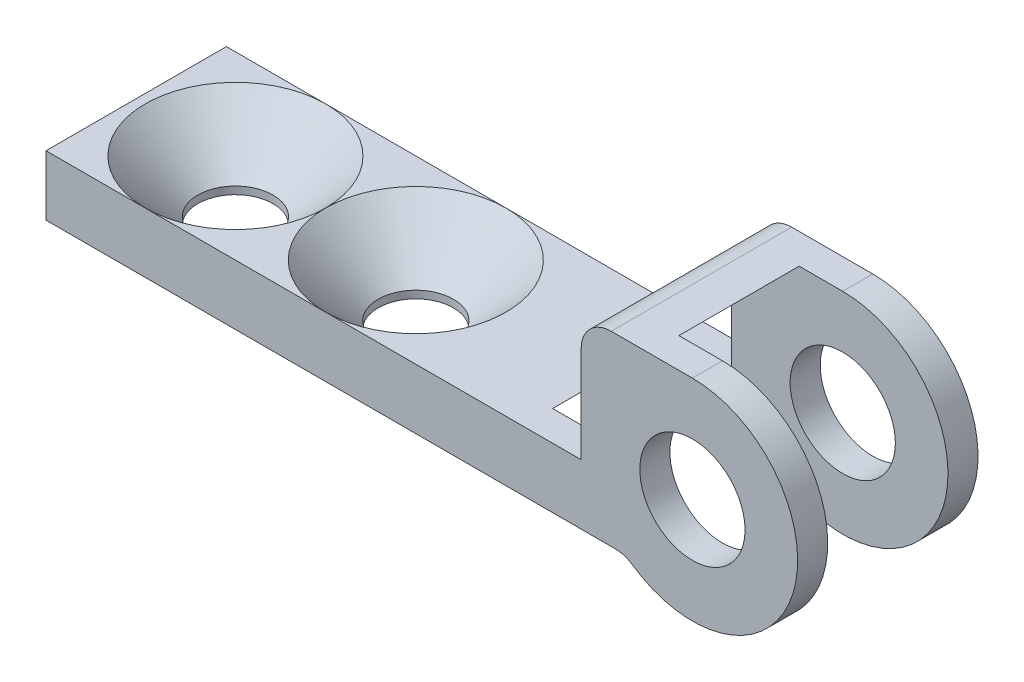
ISO-10303-21;
HEADER;
FILE_DESCRIPTION(('STEP AP214'),'2;1');
FILE_NAME('part.step','',(''),(''),'','','');
FILE_SCHEMA(('AUTOMOTIVE_DESIGN { 1 0 10303 214 1 1 1 1 }'));
ENDSEC;
DATA;
#1=APPLICATION_CONTEXT('core data for automotive mechanical design processes');
#2=APPLICATION_PROTOCOL_DEFINITION('international standard','automotive_design',2000,#1);
#3=PRODUCT_CONTEXT('',#1,'mechanical');
#4=PRODUCT('Part','Part','',(#3));
#5=PRODUCT_RELATED_PRODUCT_CATEGORY('part','',(#4));
#6=PRODUCT_DEFINITION_FORMATION('','',#4);
#7=PRODUCT_DEFINITION_CONTEXT('part definition',#1,'design');
#8=PRODUCT_DEFINITION('design','',#6,#7);
#9=PRODUCT_DEFINITION_SHAPE('','',#8);
#10=(LENGTH_UNIT() NAMED_UNIT(*) SI_UNIT(.MILLI.,.METRE.));
#11=(NAMED_UNIT(*) PLANE_ANGLE_UNIT() SI_UNIT($,.RADIAN.));
#12=(NAMED_UNIT(*) SI_UNIT($,.STERADIAN.) SOLID_ANGLE_UNIT());
#13=UNCERTAINTY_MEASURE_WITH_UNIT(LENGTH_MEASURE(1.E-05),#10,'distance_accuracy_value','');
#14=(GEOMETRIC_REPRESENTATION_CONTEXT(3) GLOBAL_UNCERTAINTY_ASSIGNED_CONTEXT((#13)) GLOBAL_UNIT_ASSIGNED_CONTEXT((#10,
#11,#12)) REPRESENTATION_CONTEXT('',''));
#15=CARTESIAN_POINT('',(0.,0.,0.));
#16=DIRECTION('',(0.,0.,1.));
#17=DIRECTION('',(1.,0.,0.));
#18=AXIS2_PLACEMENT_3D('',#15,#16,#17);
#19=CARTESIAN_POINT('',(0.86993036691125,6.15104880777221,1.5));
#20=DIRECTION('',(0.,0.,1.));
#21=DIRECTION('',(1.,0.,0.));
#22=AXIS2_PLACEMENT_3D('',#19,#20,#21);
#23=CYLINDRICAL_SURFACE('',#22,1.);
#24=CARTESIAN_POINT('',(0.86993036691125,6.15104880777221,-3.));
#25=DIRECTION('',(0.,0.,1.));
#26=DIRECTION('',(1.,0.,0.));
#27=AXIS2_PLACEMENT_3D('',#24,#25,#26);
#28=CIRCLE('',#27,1.);
#29=CARTESIAN_POINT('',(0.86993036691125,7.15104880777221,-3.));
#30=VERTEX_POINT('',#29);
#31=CARTESIAN_POINT('',(-0.13006963308875,6.15104880777221,-3.));
#32=VERTEX_POINT('',#31);
#33=EDGE_CURVE('E160',#30,#32,#28,.T.);
#34=ORIENTED_EDGE('',*,*,#33,.T.);
#35=DIRECTION('',(0.,0.,-1.));
#36=VECTOR('',#35,1.);
#37=CARTESIAN_POINT('',(-0.13006963308875,6.15104880777221,3.));
#38=LINE('',#37,#36);
#39=CARTESIAN_POINT('',(-0.13006963308875,6.15104880777221,3.));
#40=VERTEX_POINT('',#39);
#41=EDGE_CURVE('E158',#32,#40,#38,.F.);
#42=ORIENTED_EDGE('',*,*,#41,.T.);
#43=CARTESIAN_POINT('',(0.86993036691125,6.15104880777221,3.));
#44=DIRECTION('',(0.,0.,1.));
#45=DIRECTION('',(1.,0.,0.));
#46=AXIS2_PLACEMENT_3D('',#43,#44,#45);
#47=CIRCLE('',#46,1.);
#48=CARTESIAN_POINT('',(0.86993036691125,7.15104880777221,3.));
#49=VERTEX_POINT('',#48);
#50=EDGE_CURVE('E19',#40,#49,#47,.F.);
#51=ORIENTED_EDGE('',*,*,#50,.T.);
#52=DIRECTION('',(0.,0.,1.));
#53=VECTOR('',#52,1.);
#54=CARTESIAN_POINT('',(0.86993036691125,7.15104880777221,0.));
#55=LINE('',#54,#53);
#56=EDGE_CURVE('E155',#30,#49,#55,.T.);
#57=ORIENTED_EDGE('',*,*,#56,.F.);
#58=EDGE_LOOP('',(#34,#42,#51,#57));
#59=FACE_BOUND('',#58,.T.);
#60=ADVANCED_FACE('F16',(#59),#23,.T.);
#61=CARTESIAN_POINT('',(-4.49303683807458,1.55104880777221,-0.7));
#62=DIRECTION('',(0.,1.,0.));
#63=DIRECTION('',(-1.,0.,0.));
#64=AXIS2_PLACEMENT_3D('',#61,#62,#63);
#65=PLANE('',#64);
#66=DIRECTION('',(1.,0.,0.));
#67=VECTOR('',#66,1.);
#68=CARTESIAN_POINT('',(-2.525276673201,1.55104880777221,-0.4));
#69=LINE('',#68,#67);
#70=CARTESIAN_POINT('',(-3.47981710139458,1.55104880777221,-0.4));
#71=VERTEX_POINT('',#70);
#72=CARTESIAN_POINT('',(-6.27981710139458,1.55104880777221,-0.4));
#73=VERTEX_POINT('',#72);
#74=EDGE_CURVE('E217',#71,#73,#69,.F.);
#75=ORIENTED_EDGE('',*,*,#74,.T.);
#76=CARTESIAN_POINT('',(-6.27981710139458,1.55104880777221,-0.7));
#77=DIRECTION('',(0.,1.,0.));
#78=DIRECTION('',(0.,0.,1.));
#79=AXIS2_PLACEMENT_3D('',#76,#77,#78);
#80=CIRCLE('',#79,0.3);
#81=CARTESIAN_POINT('',(-6.27981710139458,1.55104880777221,-1.));
#82=VERTEX_POINT('',#81);
#83=EDGE_CURVE('E230',#73,#82,#80,.F.);
#84=ORIENTED_EDGE('',*,*,#83,.T.);
#85=DIRECTION('',(-1.,0.,0.));
#86=VECTOR('',#85,1.);
#87=CARTESIAN_POINT('',(-6.27981710139458,1.55104880777221,-1.));
#88=LINE('',#87,#86);
#89=CARTESIAN_POINT('',(-3.47981710139458,1.55104880777221,-1.));
#90=VERTEX_POINT('',#89);
#91=EDGE_CURVE('E231',#82,#90,#88,.F.);
#92=ORIENTED_EDGE('',*,*,#91,.T.);
#93=DIRECTION('',(0.,0.,1.));
#94=VECTOR('',#93,1.);
#95=CARTESIAN_POINT('',(-3.47981710139458,1.55104880777221,-0.7));
#96=LINE('',#95,#94);
#97=EDGE_CURVE('E309',#71,#90,#96,.F.);
#98=ORIENTED_EDGE('',*,*,#97,.F.);
#99=EDGE_LOOP('',(#75,#84,#92,#98));
#100=FACE_BOUND('',#99,.T.);
#101=ADVANCED_FACE('F657',(#100),#65,.F.);
#102=CARTESIAN_POINT('',(3.56993036691125,3.65104880777221,-1.));
#103=DIRECTION('',(0.,0.,1.));
#104=DIRECTION('',(1.,0.,0.));
#105=AXIS2_PLACEMENT_3D('',#102,#103,#104);
#106=CYLINDRICAL_SURFACE('',#105,1.75);
#107=CARTESIAN_POINT('',(3.56993036691125,3.65104880777221,3.));
#108=DIRECTION('',(0.,0.,1.));
#109=DIRECTION('',(1.,0.,0.));
#110=AXIS2_PLACEMENT_3D('',#107,#108,#109);
#111=CIRCLE('',#110,1.75);
#112=CARTESIAN_POINT('',(5.31993036691125,3.65104880777221,3.));
#113=VERTEX_POINT('',#112);
#114=EDGE_CURVE('E197',#113,#113,#111,.F.);
#115=ORIENTED_EDGE('',*,*,#114,.F.);
#116=EDGE_LOOP('',(#115));
#117=FACE_BOUND('',#116,.T.);
#118=CARTESIAN_POINT('',(3.56993036691125,3.65104880777221,2.));
#119=DIRECTION('',(0.,0.,1.));
#120=DIRECTION('',(1.,0.,0.));
#121=AXIS2_PLACEMENT_3D('',#118,#119,#120);
#122=CIRCLE('',#121,1.75);
#123=CARTESIAN_POINT('',(5.31993036691125,3.65104880777221,2.));
#124=VERTEX_POINT('',#123);
#125=EDGE_CURVE('E313',#124,#124,#122,.F.);
#126=ORIENTED_EDGE('',*,*,#125,.T.);
#127=EDGE_LOOP('',(#126));
#128=FACE_BOUND('',#127,.T.);
#129=ADVANCED_FACE('F544',(#117,#128),#106,.F.);
#130=CARTESIAN_POINT('',(-10.0300696330888,2.95104880777221,0.));
#131=DIRECTION('',(0.,1.,0.));
#132=DIRECTION('',(-1.,0.,0.));
#133=AXIS2_PLACEMENT_3D('',#130,#131,#132);
#134=PLANE('',#133);
#135=DIRECTION('',(1.,0.,0.));
#136=VECTOR('',#135,1.);
#137=CARTESIAN_POINT('',(1.86274959704036,2.95104880777221,3.));
#138=LINE('',#137,#136);
#139=CARTESIAN_POINT('',(-8.63006963308875,2.95104880775855,3.00000000003736));
#140=VERTEX_POINT('',#139);
#141=CARTESIAN_POINT('',(-14.6300696330888,2.95104880775855,3.00000000002305));
#142=VERTEX_POINT('',#141);
#143=EDGE_CURVE('E299',#140,#142,#138,.F.);
#144=ORIENTED_EDGE('',*,*,#143,.F.);
#145=CARTESIAN_POINT('',(-8.63006963308875,2.95104880774488,0.));
#146=DIRECTION('',(0.,1.,0.));
#147=DIRECTION('',(0.,0.,1.));
#148=AXIS2_PLACEMENT_3D('',#145,#146,#147);
#149=CIRCLE('',#148,3.00000000007471);
#150=CARTESIAN_POINT('',(-11.6300696331031,2.95104880774488,0.));
#151=VERTEX_POINT('',#150);
#152=EDGE_CURVE('E433',#140,#151,#149,.F.);
#153=ORIENTED_EDGE('',*,*,#152,.T.);
#154=CARTESIAN_POINT('',(-14.6300696330888,2.95104880774488,0.));
#155=DIRECTION('',(0.,1.,0.));
#156=DIRECTION('',(0.,0.,1.));
#157=AXIS2_PLACEMENT_3D('',#154,#155,#156);
#158=CIRCLE('',#157,3.0000000000461);
#159=EDGE_CURVE('E436',#151,#142,#158,.F.);
#160=ORIENTED_EDGE('',*,*,#159,.T.);
#161=EDGE_LOOP('',(#144,#153,#160));
#162=FACE_BOUND('',#161,.T.);
#163=ADVANCED_FACE('F534',(#162),#134,.T.);
#164=CARTESIAN_POINT('',(1.01047639878953,-0.0501936032387196,0.));
#165=DIRECTION('',(0.,0.,1.));
#166=DIRECTION('',(1.,0.,0.));
#167=AXIS2_PLACEMENT_3D('',#164,#165,#166);
#168=CYLINDRICAL_SURFACE('',#167,1.);
#169=DIRECTION('',(0.,0.,1.));
#170=VECTOR('',#169,1.);
#171=CARTESIAN_POINT('',(1.57924394726102,0.772304710319267,0.));
#172=LINE('',#171,#170);
#173=CARTESIAN_POINT('',(1.57924394726102,0.772304710319266,3.));
#174=VERTEX_POINT('',#173);
#175=CARTESIAN_POINT('',(1.57924394726102,0.772304710319266,2.));
#176=VERTEX_POINT('',#175);
#177=EDGE_CURVE('E170',#174,#176,#172,.F.);
#178=ORIENTED_EDGE('',*,*,#177,.F.);
#179=CARTESIAN_POINT('',(1.01047639878953,-0.0501936032387196,3.));
#180=DIRECTION('',(0.,0.,1.));
#181=DIRECTION('',(1.,0.,0.));
#182=AXIS2_PLACEMENT_3D('',#179,#180,#181);
#183=CIRCLE('',#182,1.);
#184=CARTESIAN_POINT('',(1.01179641786448,0.949805525535722,3.));
#185=VERTEX_POINT('',#184);
#186=EDGE_CURVE('E182',#185,#174,#183,.F.);
#187=ORIENTED_EDGE('',*,*,#186,.F.);
#188=DIRECTION('',(0.,0.,1.));
#189=VECTOR('',#188,1.);
#190=CARTESIAN_POINT('',(1.01179641786448,0.949805525535722,0.));
#191=LINE('',#190,#189);
#192=CARTESIAN_POINT('',(1.01179641786448,0.949805525535722,2.));
#193=VERTEX_POINT('',#192);
#194=EDGE_CURVE('E310',#193,#185,#191,.T.);
#195=ORIENTED_EDGE('',*,*,#194,.F.);
#196=CARTESIAN_POINT('',(1.01047639878953,-0.0501936032387196,2.));
#197=DIRECTION('',(0.,0.,1.));
#198=DIRECTION('',(1.,0.,0.));
#199=AXIS2_PLACEMENT_3D('',#196,#197,#198);
#200=CIRCLE('',#199,1.);
#201=EDGE_CURVE('E209',#193,#176,#200,.F.);
#202=ORIENTED_EDGE('',*,*,#201,.T.);
#203=EDGE_LOOP('',(#178,#187,#195,#202));
#204=FACE_BOUND('',#203,.T.);
#205=ADVANCED_FACE('F532',(#204),#168,.F.);
#206=CARTESIAN_POINT('',(3.56993036691125,3.65104880777221,0.));
#207=DIRECTION('',(0.,0.,1.));
#208=DIRECTION('',(1.,0.,0.));
#209=AXIS2_PLACEMENT_3D('',#206,#207,#208);
#210=CYLINDRICAL_SURFACE('',#209,3.5);
#211=DIRECTION('',(0.,0.,1.));
#212=VECTOR('',#211,1.);
#213=CARTESIAN_POINT('',(3.56993036691125,7.15104880777221,0.));
#214=LINE('',#213,#212);
#215=CARTESIAN_POINT('',(3.56993036691125,7.15104880777221,3.));
#216=VERTEX_POINT('',#215);
#217=CARTESIAN_POINT('',(3.56993036691125,7.15104880777221,2.));
#218=VERTEX_POINT('',#217);
#219=EDGE_CURVE('E169',#216,#218,#214,.F.);
#220=ORIENTED_EDGE('',*,*,#219,.F.);
#221=CARTESIAN_POINT('',(3.56993036691125,3.65104880777221,3.));
#222=DIRECTION('',(0.,0.,1.));
#223=DIRECTION('',(1.,0.,0.));
#224=AXIS2_PLACEMENT_3D('',#221,#222,#223);
#225=CIRCLE('',#224,3.5);
#226=EDGE_CURVE('E176',#174,#216,#225,.T.);
#227=ORIENTED_EDGE('',*,*,#226,.F.);
#228=ORIENTED_EDGE('',*,*,#177,.T.);
#229=CARTESIAN_POINT('',(3.56993036691125,3.65104880777221,2.));
#230=DIRECTION('',(0.,0.,1.));
#231=DIRECTION('',(1.,0.,0.));
#232=AXIS2_PLACEMENT_3D('',#229,#230,#231);
#233=CIRCLE('',#232,3.5);
#234=EDGE_CURVE('E203',#176,#218,#233,.T.);
#235=ORIENTED_EDGE('',*,*,#234,.T.);
#236=EDGE_LOOP('',(#220,#227,#228,#235));
#237=FACE_BOUND('',#236,.T.);
#238=ADVANCED_FACE('F529',(#237),#210,.T.);
#239=CARTESIAN_POINT('',(-10.0300696330888,2.95104880777221,0.));
#240=DIRECTION('',(0.,1.,0.));
#241=DIRECTION('',(-1.,0.,0.));
#242=AXIS2_PLACEMENT_3D('',#239,#240,#241);
#243=PLANE('',#242);
#244=CARTESIAN_POINT('',(-8.63006963308875,2.95104880774488,0.));
#245=DIRECTION('',(0.,1.,0.));
#246=DIRECTION('',(0.,0.,1.));
#247=AXIS2_PLACEMENT_3D('',#244,#245,#246);
#248=CIRCLE('',#247,3.00000000007471);
#249=CARTESIAN_POINT('',(-8.63006963308875,2.95104880775855,-3.00000000003736));
#250=VERTEX_POINT('',#249);
#251=EDGE_CURVE('E431',#151,#250,#248,.F.);
#252=ORIENTED_EDGE('',*,*,#251,.T.);
#253=DIRECTION('',(1.,0.,0.));
#254=VECTOR('',#253,1.);
#255=CARTESIAN_POINT('',(1.86274959704036,2.95104880777221,-3.));
#256=LINE('',#255,#254);
#257=CARTESIAN_POINT('',(-14.6300696330888,2.95104880775855,-3.00000000002305));
#258=VERTEX_POINT('',#257);
#259=EDGE_CURVE('E270',#250,#258,#256,.F.);
#260=ORIENTED_EDGE('',*,*,#259,.T.);
#261=CARTESIAN_POINT('',(-14.6300696330888,2.95104880774488,0.));
#262=DIRECTION('',(0.,1.,0.));
#263=DIRECTION('',(0.,0.,1.));
#264=AXIS2_PLACEMENT_3D('',#261,#262,#263);
#265=CIRCLE('',#264,3.0000000000461);
#266=EDGE_CURVE('E438',#258,#151,#265,.F.);
#267=ORIENTED_EDGE('',*,*,#266,.T.);
#268=EDGE_LOOP('',(#252,#260,#267));
#269=FACE_BOUND('',#268,.T.);
#270=ADVANCED_FACE('F542',(#269),#243,.T.);
#271=CARTESIAN_POINT('',(-10.0300696330888,2.95104880777221,0.));
#272=DIRECTION('',(0.,1.,0.));
#273=DIRECTION('',(-1.,0.,0.));
#274=AXIS2_PLACEMENT_3D('',#271,#272,#273);
#275=PLANE('',#274);
#276=DIRECTION('',(0.,0.,1.));
#277=VECTOR('',#276,1.);
#278=CARTESIAN_POINT('',(-17.9300696330888,2.95104880777221,0.));
#279=LINE('',#278,#277);
#280=CARTESIAN_POINT('',(-17.9300696330888,2.95104880777221,3.));
#281=VERTEX_POINT('',#280);
#282=CARTESIAN_POINT('',(-17.9300696330888,2.95104880777221,-3.));
#283=VERTEX_POINT('',#282);
#284=EDGE_CURVE('E177',#281,#283,#279,.F.);
#285=ORIENTED_EDGE('',*,*,#284,.F.);
#286=DIRECTION('',(1.,0.,0.));
#287=VECTOR('',#286,1.);
#288=CARTESIAN_POINT('',(1.86274959704036,2.95104880777221,3.));
#289=LINE('',#288,#287);
#290=EDGE_CURVE('E191',#142,#281,#289,.F.);
#291=ORIENTED_EDGE('',*,*,#290,.F.);
#292=CARTESIAN_POINT('',(-14.6300696330888,2.95104880774488,0.));
#293=DIRECTION('',(0.,1.,0.));
#294=DIRECTION('',(0.,0.,1.));
#295=AXIS2_PLACEMENT_3D('',#292,#293,#294);
#296=CIRCLE('',#295,3.0000000000461);
#297=EDGE_CURVE('E293',#142,#258,#296,.F.);
#298=ORIENTED_EDGE('',*,*,#297,.T.);
#299=DIRECTION('',(1.,0.,0.));
#300=VECTOR('',#299,1.);
#301=CARTESIAN_POINT('',(1.86274959704036,2.95104880777221,-3.));
#302=LINE('',#301,#300);
#303=EDGE_CURVE('E273',#258,#283,#302,.F.);
#304=ORIENTED_EDGE('',*,*,#303,.T.);
#305=EDGE_LOOP('',(#285,#291,#298,#304));
#306=FACE_BOUND('',#305,.T.);
#307=ADVANCED_FACE('F625',(#306),#275,.T.);
#308=CARTESIAN_POINT('',(2.12018289860541,7.15104880777221,0.));
#309=DIRECTION('',(0.,1.,0.));
#310=DIRECTION('',(0.,0.,1.));
#311=AXIS2_PLACEMENT_3D('',#308,#309,#310);
#312=PLANE('',#311);
#313=DIRECTION('',(0.,0.,1.));
#314=VECTOR('',#313,1.);
#315=CARTESIAN_POINT('',(3.56993036691125,7.15104880777221,0.));
#316=LINE('',#315,#314);
#317=CARTESIAN_POINT('',(3.56993036691125,7.15104880777221,-3.));
#318=VERTEX_POINT('',#317);
#319=CARTESIAN_POINT('',(3.56993036691125,7.15104880777221,-2.));
#320=VERTEX_POINT('',#319);
#321=EDGE_CURVE('E237',#318,#320,#316,.T.);
#322=ORIENTED_EDGE('',*,*,#321,.F.);
#323=DIRECTION('',(1.,0.,0.));
#324=VECTOR('',#323,1.);
#325=CARTESIAN_POINT('',(1.86274959704036,7.15104880777221,-3.));
#326=LINE('',#325,#324);
#327=EDGE_CURVE('E168',#318,#30,#326,.F.);
#328=ORIENTED_EDGE('',*,*,#327,.T.);
#329=ORIENTED_EDGE('',*,*,#56,.T.);
#330=DIRECTION('',(1.,0.,0.));
#331=VECTOR('',#330,1.);
#332=CARTESIAN_POINT('',(1.86274959704036,7.15104880777221,3.));
#333=LINE('',#332,#331);
#334=EDGE_CURVE('E165',#216,#49,#333,.F.);
#335=ORIENTED_EDGE('',*,*,#334,.F.);
#336=ORIENTED_EDGE('',*,*,#219,.T.);
#337=DIRECTION('',(1.,0.,0.));
#338=VECTOR('',#337,1.);
#339=CARTESIAN_POINT('',(1.86274959704036,7.15104880777221,2.));
#340=LINE('',#339,#338);
#341=CARTESIAN_POINT('',(2.12018289860541,7.15104880777221,2.));
#342=VERTEX_POINT('',#341);
#343=EDGE_CURVE('E200',#218,#342,#340,.F.);
#344=ORIENTED_EDGE('',*,*,#343,.T.);
#345=DIRECTION('',(0.,0.,1.));
#346=VECTOR('',#345,1.);
#347=CARTESIAN_POINT('',(2.12018289860541,7.15104880777221,0.));
#348=LINE('',#347,#346);
#349=CARTESIAN_POINT('',(2.12018289860541,7.15104880777221,-2.));
#350=VERTEX_POINT('',#349);
#351=EDGE_CURVE('E240',#342,#350,#348,.F.);
#352=ORIENTED_EDGE('',*,*,#351,.T.);
#353=DIRECTION('',(1.,0.,0.));
#354=VECTOR('',#353,1.);
#355=CARTESIAN_POINT('',(2.12018289860541,7.15104880777221,-2.));
#356=LINE('',#355,#354);
#357=EDGE_CURVE('E244',#350,#320,#356,.T.);
#358=ORIENTED_EDGE('',*,*,#357,.T.);
#359=EDGE_LOOP('',(#322,#328,#329,#335,#336,#344,#352,#358));
#360=FACE_BOUND('',#359,.T.);
#361=ADVANCED_FACE('F163',(#360),#312,.T.);
#362=CARTESIAN_POINT('',(-10.0300696330888,2.95104880777221,0.));
#363=DIRECTION('',(0.,1.,0.));
#364=DIRECTION('',(-1.,0.,0.));
#365=AXIS2_PLACEMENT_3D('',#362,#363,#364);
#366=PLANE('',#365);
#367=DIRECTION('',(0.,0.,-1.));
#368=VECTOR('',#367,1.);
#369=CARTESIAN_POINT('',(-0.13006963308875,2.95104880777221,3.));
#370=LINE('',#369,#368);
#371=CARTESIAN_POINT('',(-0.13006963308875,2.95104880777221,-2.));
#372=VERTEX_POINT('',#371);
#373=CARTESIAN_POINT('',(-0.13006963308875,2.95104880777221,-3.));
#374=VERTEX_POINT('',#373);
#375=EDGE_CURVE('E235',#372,#374,#370,.T.);
#376=ORIENTED_EDGE('',*,*,#375,.T.);
#377=DIRECTION('',(1.,0.,0.));
#378=VECTOR('',#377,1.);
#379=CARTESIAN_POINT('',(1.86274959704036,2.95104880777221,-3.));
#380=LINE('',#379,#378);
#381=EDGE_CURVE('E274',#374,#250,#380,.F.);
#382=ORIENTED_EDGE('',*,*,#381,.T.);
#383=CARTESIAN_POINT('',(-8.63006963308875,2.95104880774488,0.));
#384=DIRECTION('',(0.,1.,0.));
#385=DIRECTION('',(0.,0.,1.));
#386=AXIS2_PLACEMENT_3D('',#383,#384,#385);
#387=CIRCLE('',#386,3.00000000007471);
#388=EDGE_CURVE('E359',#250,#140,#387,.F.);
#389=ORIENTED_EDGE('',*,*,#388,.T.);
#390=DIRECTION('',(1.,0.,0.));
#391=VECTOR('',#390,1.);
#392=CARTESIAN_POINT('',(1.86274959704036,2.95104880777221,3.));
#393=LINE('',#392,#391);
#394=CARTESIAN_POINT('',(-0.13006963308875,2.95104880777221,3.));
#395=VERTEX_POINT('',#394);
#396=EDGE_CURVE('E196',#395,#140,#393,.F.);
#397=ORIENTED_EDGE('',*,*,#396,.F.);
#398=DIRECTION('',(0.,0.,-1.));
#399=VECTOR('',#398,1.);
#400=CARTESIAN_POINT('',(-0.13006963308875,2.95104880777221,3.));
#401=LINE('',#400,#399);
#402=CARTESIAN_POINT('',(-0.13006963308875,2.95104880777221,2.));
#403=VERTEX_POINT('',#402);
#404=EDGE_CURVE('E236',#395,#403,#401,.T.);
#405=ORIENTED_EDGE('',*,*,#404,.T.);
#406=DIRECTION('',(1.,0.,0.));
#407=VECTOR('',#406,1.);
#408=CARTESIAN_POINT('',(1.86274959704036,2.95104880777221,2.));
#409=LINE('',#408,#407);
#410=CARTESIAN_POINT('',(-2.07981710139458,2.95104880777221,2.));
#411=VERTEX_POINT('',#410);
#412=EDGE_CURVE('E386',#403,#411,#409,.F.);
#413=ORIENTED_EDGE('',*,*,#412,.T.);
#414=DIRECTION('',(0.,0.,1.));
#415=VECTOR('',#414,1.);
#416=CARTESIAN_POINT('',(-2.07981710139458,2.95104880777222,0.));
#417=LINE('',#416,#415);
#418=CARTESIAN_POINT('',(-2.07981710139458,2.95104880777221,-2.));
#419=VERTEX_POINT('',#418);
#420=EDGE_CURVE('E211',#411,#419,#417,.F.);
#421=ORIENTED_EDGE('',*,*,#420,.T.);
#422=DIRECTION('',(1.,0.,0.));
#423=VECTOR('',#422,1.);
#424=CARTESIAN_POINT('',(1.86274959704036,2.95104880777221,-2.));
#425=LINE('',#424,#423);
#426=EDGE_CURVE('E262',#372,#419,#425,.F.);
#427=ORIENTED_EDGE('',*,*,#426,.F.);
#428=EDGE_LOOP('',(#376,#382,#389,#397,#405,#413,#421,#427));
#429=FACE_BOUND('',#428,.T.);
#430=ADVANCED_FACE('F519',(#429),#366,.T.);
#431=CARTESIAN_POINT('',(1.01047639878953,-0.0501936032387196,0.));
#432=DIRECTION('',(0.,0.,1.));
#433=DIRECTION('',(1.,0.,0.));
#434=AXIS2_PLACEMENT_3D('',#431,#432,#433);
#435=CYLINDRICAL_SURFACE('',#434,1.);
#436=DIRECTION('',(0.,0.,1.));
#437=VECTOR('',#436,1.);
#438=CARTESIAN_POINT('',(1.57924394726102,0.772304710319267,0.));
#439=LINE('',#438,#437);
#440=CARTESIAN_POINT('',(1.57924394726102,0.772304710319266,-2.));
#441=VERTEX_POINT('',#440);
#442=CARTESIAN_POINT('',(1.57924394726102,0.772304710319266,-3.));
#443=VERTEX_POINT('',#442);
#444=EDGE_CURVE('E241',#441,#443,#439,.F.);
#445=ORIENTED_EDGE('',*,*,#444,.F.);
#446=CARTESIAN_POINT('',(1.01047639878953,-0.0501936032387196,-2.));
#447=DIRECTION('',(0.,0.,1.));
#448=DIRECTION('',(1.,0.,0.));
#449=AXIS2_PLACEMENT_3D('',#446,#447,#448);
#450=CIRCLE('',#449,1.);
#451=CARTESIAN_POINT('',(1.01179641786448,0.949805525535722,-2.));
#452=VERTEX_POINT('',#451);
#453=EDGE_CURVE('E412',#452,#441,#450,.F.);
#454=ORIENTED_EDGE('',*,*,#453,.F.);
#455=DIRECTION('',(0.,0.,1.));
#456=VECTOR('',#455,1.);
#457=CARTESIAN_POINT('',(1.01179641786448,0.949805525535722,0.));
#458=LINE('',#457,#456);
#459=CARTESIAN_POINT('',(1.01179641786448,0.949805525535722,-3.));
#460=VERTEX_POINT('',#459);
#461=EDGE_CURVE('E245',#460,#452,#458,.T.);
#462=ORIENTED_EDGE('',*,*,#461,.F.);
#463=CARTESIAN_POINT('',(1.01047639878953,-0.0501936032387196,-3.));
#464=DIRECTION('',(0.,0.,1.));
#465=DIRECTION('',(1.,0.,0.));
#466=AXIS2_PLACEMENT_3D('',#463,#464,#465);
#467=CIRCLE('',#466,1.);
#468=EDGE_CURVE('E284',#460,#443,#467,.F.);
#469=ORIENTED_EDGE('',*,*,#468,.T.);
#470=EDGE_LOOP('',(#445,#454,#462,#469));
#471=FACE_BOUND('',#470,.T.);
#472=ADVANCED_FACE('F616',(#471),#435,.F.);
#473=CARTESIAN_POINT('',(3.56993036691125,3.65104880777221,0.));
#474=DIRECTION('',(0.,0.,1.));
#475=DIRECTION('',(1.,0.,0.));
#476=AXIS2_PLACEMENT_3D('',#473,#474,#475);
#477=CYLINDRICAL_SURFACE('',#476,3.5);
#478=ORIENTED_EDGE('',*,*,#321,.T.);
#479=CARTESIAN_POINT('',(3.56993036691125,3.65104880777221,-2.));
#480=DIRECTION('',(0.,0.,1.));
#481=DIRECTION('',(1.,0.,0.));
#482=AXIS2_PLACEMENT_3D('',#479,#480,#481);
#483=CIRCLE('',#482,3.5);
#484=EDGE_CURVE('E398',#441,#320,#483,.T.);
#485=ORIENTED_EDGE('',*,*,#484,.F.);
#486=ORIENTED_EDGE('',*,*,#444,.T.);
#487=CARTESIAN_POINT('',(3.56993036691125,3.65104880777221,-3.));
#488=DIRECTION('',(0.,0.,1.));
#489=DIRECTION('',(1.,0.,0.));
#490=AXIS2_PLACEMENT_3D('',#487,#488,#489);
#491=CIRCLE('',#490,3.5);
#492=EDGE_CURVE('E417',#443,#318,#491,.T.);
#493=ORIENTED_EDGE('',*,*,#492,.T.);
#494=EDGE_LOOP('',(#478,#485,#486,#493));
#495=FACE_BOUND('',#494,.T.);
#496=ADVANCED_FACE('F613',(#495),#477,.T.);
#497=CARTESIAN_POINT('',(2.12018289860541,7.15104880777221,0.));
#498=DIRECTION('',(-0.707106781186548,0.707106781186547,0.));
#499=DIRECTION('',(-0.707106781186547,-0.707106781186548,0.));
#500=AXIS2_PLACEMENT_3D('',#497,#498,#499);
#501=PLANE('',#500);
#502=DIRECTION('',(-0.707106781186546,-0.707106781186549,0.));
#503=VECTOR('',#502,1.);
#504=CARTESIAN_POINT('',(2.12018289860541,7.15104880777221,-2.));
#505=LINE('',#504,#503);
#506=CARTESIAN_POINT('',(-0.130069633088752,4.90079627607804,-2.));
#507=VERTEX_POINT('',#506);
#508=EDGE_CURVE('E381',#350,#507,#505,.T.);
#509=ORIENTED_EDGE('',*,*,#508,.F.);
#510=ORIENTED_EDGE('',*,*,#351,.F.);
#511=DIRECTION('',(-0.707106781186546,-0.707106781186549,0.));
#512=VECTOR('',#511,1.);
#513=CARTESIAN_POINT('',(2.12018289860541,7.15104880777221,2.));
#514=LINE('',#513,#512);
#515=CARTESIAN_POINT('',(-0.130069633088752,4.90079627607804,2.));
#516=VERTEX_POINT('',#515);
#517=EDGE_CURVE('E202',#342,#516,#514,.T.);
#518=ORIENTED_EDGE('',*,*,#517,.T.);
#519=DIRECTION('',(0.,0.,-1.));
#520=VECTOR('',#519,1.);
#521=CARTESIAN_POINT('',(-0.13006963308875,4.90079627607804,3.));
#522=LINE('',#521,#520);
#523=EDGE_CURVE('E232',#516,#507,#522,.T.);
#524=ORIENTED_EDGE('',*,*,#523,.T.);
#525=EDGE_LOOP('',(#509,#510,#518,#524));
#526=FACE_BOUND('',#525,.T.);
#527=ADVANCED_FACE('F525',(#526),#501,.F.);
#528=CARTESIAN_POINT('',(-0.13006963308875,7.15104880777221,3.));
#529=DIRECTION('',(1.,0.,0.));
#530=DIRECTION('',(0.,0.,-1.));
#531=AXIS2_PLACEMENT_3D('',#528,#529,#530);
#532=PLANE('',#531);
#533=DIRECTION('',(0.,1.,0.));
#534=VECTOR('',#533,1.);
#535=CARTESIAN_POINT('',(-0.13006963308875,3.21824159222137,-3.));
#536=LINE('',#535,#534);
#537=EDGE_CURVE('E289',#32,#374,#536,.F.);
#538=ORIENTED_EDGE('',*,*,#537,.T.);
#539=ORIENTED_EDGE('',*,*,#375,.F.);
#540=DIRECTION('',(0.,1.,0.));
#541=VECTOR('',#540,1.);
#542=CARTESIAN_POINT('',(-0.13006963308875,3.21824159222137,-2.));
#543=LINE('',#542,#541);
#544=EDGE_CURVE('E377',#507,#372,#543,.F.);
#545=ORIENTED_EDGE('',*,*,#544,.F.);
#546=ORIENTED_EDGE('',*,*,#523,.F.);
#547=DIRECTION('',(0.,1.,0.));
#548=VECTOR('',#547,1.);
#549=CARTESIAN_POINT('',(-0.13006963308875,3.21824159222138,2.));
#550=LINE('',#549,#548);
#551=EDGE_CURVE('E347',#516,#403,#550,.F.);
#552=ORIENTED_EDGE('',*,*,#551,.T.);
#553=ORIENTED_EDGE('',*,*,#404,.F.);
#554=DIRECTION('',(0.,1.,0.));
#555=VECTOR('',#554,1.);
#556=CARTESIAN_POINT('',(-0.13006963308875,3.21824159222138,3.));
#557=LINE('',#556,#555);
#558=EDGE_CURVE('E194',#40,#395,#557,.F.);
#559=ORIENTED_EDGE('',*,*,#558,.F.);
#560=ORIENTED_EDGE('',*,*,#41,.F.);
#561=EDGE_LOOP('',(#538,#539,#545,#546,#552,#553,#559,#560));
#562=FACE_BOUND('',#561,.T.);
#563=ADVANCED_FACE('F444',(#562),#532,.F.);
#564=CARTESIAN_POINT('',(3.56993036691125,3.65104880777221,-1.));
#565=DIRECTION('',(0.,0.,1.));
#566=DIRECTION('',(1.,0.,0.));
#567=AXIS2_PLACEMENT_3D('',#564,#565,#566);
#568=CYLINDRICAL_SURFACE('',#567,1.75);
#569=CARTESIAN_POINT('',(3.56993036691125,3.65104880777221,-2.));
#570=DIRECTION('',(0.,0.,1.));
#571=DIRECTION('',(1.,0.,0.));
#572=AXIS2_PLACEMENT_3D('',#569,#570,#571);
#573=CIRCLE('',#572,1.75);
#574=CARTESIAN_POINT('',(5.31993036691125,3.65104880777221,-2.));
#575=VERTEX_POINT('',#574);
#576=EDGE_CURVE('E380',#575,#575,#573,.F.);
#577=ORIENTED_EDGE('',*,*,#576,.F.);
#578=EDGE_LOOP('',(#577));
#579=FACE_BOUND('',#578,.T.);
#580=CARTESIAN_POINT('',(3.56993036691125,3.65104880777221,-3.));
#581=DIRECTION('',(0.,0.,1.));
#582=DIRECTION('',(1.,0.,0.));
#583=AXIS2_PLACEMENT_3D('',#580,#581,#582);
#584=CIRCLE('',#583,1.75);
#585=CARTESIAN_POINT('',(5.31993036691125,3.65104880777221,-3.));
#586=VERTEX_POINT('',#585);
#587=EDGE_CURVE('E248',#586,#586,#584,.F.);
#588=ORIENTED_EDGE('',*,*,#587,.T.);
#589=EDGE_LOOP('',(#588));
#590=FACE_BOUND('',#589,.T.);
#591=ADVANCED_FACE('F604',(#579,#590),#568,.F.);
#592=CARTESIAN_POINT('',(-14.6300696330888,2.95104880763119,0.));
#593=DIRECTION('',(0.,1.,0.));
#594=DIRECTION('',(0.,0.,1.));
#595=AXIS2_PLACEMENT_3D('',#592,#593,#594);
#596=CONICAL_SURFACE('',#595,2.99999999993242,0.785398163397448);
#597=CARTESIAN_POINT('',(-14.6300696330888,1.20104880777221,0.));
#598=DIRECTION('',(0.,1.,0.));
#599=DIRECTION('',(-1.,0.,0.));
#600=AXIS2_PLACEMENT_3D('',#597,#598,#599);
#601=CIRCLE('',#600,1.25);
#602=CARTESIAN_POINT('',(-15.8800696330888,1.20104880777221,0.));
#603=VERTEX_POINT('',#602);
#604=EDGE_CURVE('E409',#603,#603,#601,.F.);
#605=ORIENTED_EDGE('',*,*,#604,.T.);
#606=EDGE_LOOP('',(#605));
#607=FACE_BOUND('',#606,.T.);
#608=ORIENTED_EDGE('',*,*,#266,.F.);
#609=ORIENTED_EDGE('',*,*,#297,.F.);
#610=ORIENTED_EDGE('',*,*,#159,.F.);
#611=EDGE_LOOP('',(#608,#609,#610));
#612=FACE_BOUND('',#611,.T.);
#613=ADVANCED_FACE('F600',(#607,#612),#596,.F.);
#614=CARTESIAN_POINT('',(-8.63006963308875,2.95104880763119,0.));
#615=DIRECTION('',(0.,1.,0.));
#616=DIRECTION('',(0.,0.,1.));
#617=AXIS2_PLACEMENT_3D('',#614,#615,#616);
#618=CONICAL_SURFACE('',#617,2.99999999996102,0.785398163397448);
#619=CARTESIAN_POINT('',(-8.63006963308875,1.20104880777221,0.));
#620=DIRECTION('',(0.,1.,0.));
#621=DIRECTION('',(-1.,0.,0.));
#622=AXIS2_PLACEMENT_3D('',#619,#620,#621);
#623=CIRCLE('',#622,1.25);
#624=CARTESIAN_POINT('',(-9.88006963308875,1.20104880777221,0.));
#625=VERTEX_POINT('',#624);
#626=EDGE_CURVE('E459',#625,#625,#623,.F.);
#627=ORIENTED_EDGE('',*,*,#626,.T.);
#628=EDGE_LOOP('',(#627));
#629=FACE_BOUND('',#628,.T.);
#630=ORIENTED_EDGE('',*,*,#251,.F.);
#631=ORIENTED_EDGE('',*,*,#152,.F.);
#632=ORIENTED_EDGE('',*,*,#388,.F.);
#633=EDGE_LOOP('',(#630,#631,#632));
#634=FACE_BOUND('',#633,.T.);
#635=ADVANCED_FACE('F596',(#629,#634),#618,.F.);
#636=CARTESIAN_POINT('',(-6.27981710139458,0.951048807772208,-1.));
#637=DIRECTION('',(0.,0.,-1.));
#638=DIRECTION('',(-1.,0.,0.));
#639=AXIS2_PLACEMENT_3D('',#636,#637,#638);
#640=PLANE('',#639);
#641=ORIENTED_EDGE('',*,*,#91,.F.);
#642=DIRECTION('',(0.,1.,0.));
#643=VECTOR('',#642,1.);
#644=CARTESIAN_POINT('',(-6.27981710139458,0.951048807772208,-1.));
#645=LINE('',#644,#643);
#646=CARTESIAN_POINT('',(-6.27981710139458,0.951048807772208,-1.));
#647=VERTEX_POINT('',#646);
#648=EDGE_CURVE('E228',#82,#647,#645,.F.);
#649=ORIENTED_EDGE('',*,*,#648,.T.);
#650=DIRECTION('',(1.,0.,0.));
#651=VECTOR('',#650,1.);
#652=CARTESIAN_POINT('',(0.0699303669112483,0.951048807772209,-1.));
#653=LINE('',#652,#651);
#654=CARTESIAN_POINT('',(-4.07981710139458,0.951048807772209,-1.));
#655=VERTEX_POINT('',#654);
#656=EDGE_CURVE('E406',#655,#647,#653,.F.);
#657=ORIENTED_EDGE('',*,*,#656,.F.);
#658=DIRECTION('',(-0.707106781186547,-0.707106781186548,0.));
#659=VECTOR('',#658,1.);
#660=CARTESIAN_POINT('',(2.12018289860541,7.15104880777221,-1.));
#661=LINE('',#660,#659);
#662=EDGE_CURVE('E210',#655,#90,#661,.F.);
#663=ORIENTED_EDGE('',*,*,#662,.T.);
#664=EDGE_LOOP('',(#641,#649,#657,#663));
#665=FACE_BOUND('',#664,.T.);
#666=ADVANCED_FACE('F592',(#665),#640,.F.);
#667=CARTESIAN_POINT('',(-6.27981710139458,0.951048807772208,-0.7));
#668=DIRECTION('',(0.,1.,0.));
#669=DIRECTION('',(0.,0.,1.));
#670=AXIS2_PLACEMENT_3D('',#667,#668,#669);
#671=CYLINDRICAL_SURFACE('',#670,0.3);
#672=DIRECTION('',(0.,1.,0.));
#673=VECTOR('',#672,1.);
#674=CARTESIAN_POINT('',(-6.27981710139458,0.951048807772209,-0.4));
#675=LINE('',#674,#673);
#676=CARTESIAN_POINT('',(-6.27981710139458,0.951048807772208,-0.4));
#677=VERTEX_POINT('',#676);
#678=EDGE_CURVE('E215',#73,#677,#675,.F.);
#679=ORIENTED_EDGE('',*,*,#678,.T.);
#680=CARTESIAN_POINT('',(-6.27981710139458,0.951048807772208,-0.7));
#681=DIRECTION('',(0.,1.,0.));
#682=DIRECTION('',(0.,0.,1.));
#683=AXIS2_PLACEMENT_3D('',#680,#681,#682);
#684=CIRCLE('',#683,0.3);
#685=EDGE_CURVE('E403',#647,#677,#684,.T.);
#686=ORIENTED_EDGE('',*,*,#685,.F.);
#687=ORIENTED_EDGE('',*,*,#648,.F.);
#688=ORIENTED_EDGE('',*,*,#83,.F.);
#689=EDGE_LOOP('',(#679,#686,#687,#688));
#690=FACE_BOUND('',#689,.T.);
#691=ADVANCED_FACE('F588',(#690),#671,.F.);
#692=CARTESIAN_POINT('',(-2.525276673201,0.951048807772209,-0.4));
#693=DIRECTION('',(0.,0.,1.));
#694=DIRECTION('',(1.,0.,0.));
#695=AXIS2_PLACEMENT_3D('',#692,#693,#694);
#696=PLANE('',#695);
#697=DIRECTION('',(1.,0.,0.));
#698=VECTOR('',#697,1.);
#699=CARTESIAN_POINT('',(0.0699303669112483,0.951048807772209,-0.4));
#700=LINE('',#699,#698);
#701=CARTESIAN_POINT('',(-4.07981710139458,0.951048807772209,-0.4));
#702=VERTEX_POINT('',#701);
#703=EDGE_CURVE('E222',#677,#702,#700,.T.);
#704=ORIENTED_EDGE('',*,*,#703,.F.);
#705=ORIENTED_EDGE('',*,*,#678,.F.);
#706=ORIENTED_EDGE('',*,*,#74,.F.);
#707=DIRECTION('',(-0.707106781186547,-0.707106781186548,0.));
#708=VECTOR('',#707,1.);
#709=CARTESIAN_POINT('',(2.12018289860541,7.15104880777221,-0.4));
#710=LINE('',#709,#708);
#711=EDGE_CURVE('E214',#71,#702,#710,.T.);
#712=ORIENTED_EDGE('',*,*,#711,.T.);
#713=EDGE_LOOP('',(#704,#705,#706,#712));
#714=FACE_BOUND('',#713,.T.);
#715=ADVANCED_FACE('F585',(#714),#696,.F.);
#716=CARTESIAN_POINT('',(2.12018289860541,7.15104880777221,0.));
#717=DIRECTION('',(-0.707106781186548,0.707106781186547,0.));
#718=DIRECTION('',(-0.707106781186547,-0.707106781186548,0.));
#719=AXIS2_PLACEMENT_3D('',#716,#717,#718);
#720=PLANE('',#719);
#721=DIRECTION('',(0.,0.,1.));
#722=VECTOR('',#721,1.);
#723=CARTESIAN_POINT('',(-4.07981710139458,0.95104880777221,0.));
#724=LINE('',#723,#722);
#725=CARTESIAN_POINT('',(-4.07981710139458,0.951048807772209,-2.));
#726=VERTEX_POINT('',#725);
#727=EDGE_CURVE('E34',#726,#655,#724,.T.);
#728=ORIENTED_EDGE('',*,*,#727,.F.);
#729=DIRECTION('',(-0.707106781186547,-0.707106781186548,0.));
#730=VECTOR('',#729,1.);
#731=CARTESIAN_POINT('',(-2.07981710139458,2.95104880777221,-2.));
#732=LINE('',#731,#730);
#733=EDGE_CURVE('E362',#419,#726,#732,.T.);
#734=ORIENTED_EDGE('',*,*,#733,.F.);
#735=ORIENTED_EDGE('',*,*,#420,.F.);
#736=DIRECTION('',(-0.707106781186547,-0.707106781186548,0.));
#737=VECTOR('',#736,1.);
#738=CARTESIAN_POINT('',(-2.07981710139458,2.95104880777221,2.));
#739=LINE('',#738,#737);
#740=CARTESIAN_POINT('',(-4.07981710139458,0.951048807772209,2.));
#741=VERTEX_POINT('',#740);
#742=EDGE_CURVE('E206',#411,#741,#739,.T.);
#743=ORIENTED_EDGE('',*,*,#742,.T.);
#744=DIRECTION('',(0.,0.,1.));
#745=VECTOR('',#744,1.);
#746=CARTESIAN_POINT('',(-4.07981710139458,0.951048807772208,0.));
#747=LINE('',#746,#745);
#748=EDGE_CURVE('E218',#702,#741,#747,.T.);
#749=ORIENTED_EDGE('',*,*,#748,.F.);
#750=ORIENTED_EDGE('',*,*,#711,.F.);
#751=ORIENTED_EDGE('',*,*,#97,.T.);
#752=ORIENTED_EDGE('',*,*,#662,.F.);
#753=EDGE_LOOP('',(#728,#734,#735,#743,#749,#750,#751,#752));
#754=FACE_BOUND('',#753,.T.);
#755=ADVANCED_FACE('F515',(#754),#720,.F.);
#756=CARTESIAN_POINT('',(1.86274959704036,3.21824159222138,2.));
#757=DIRECTION('',(0.,0.,1.));
#758=DIRECTION('',(1.,0.,0.));
#759=AXIS2_PLACEMENT_3D('',#756,#757,#758);
#760=PLANE('',#759);
#761=ORIENTED_EDGE('',*,*,#125,.F.);
#762=EDGE_LOOP('',(#761));
#763=FACE_BOUND('',#762,.T.);
#764=ORIENTED_EDGE('',*,*,#551,.F.);
#765=ORIENTED_EDGE('',*,*,#517,.F.);
#766=ORIENTED_EDGE('',*,*,#343,.F.);
#767=ORIENTED_EDGE('',*,*,#234,.F.);
#768=ORIENTED_EDGE('',*,*,#201,.F.);
#769=DIRECTION('',(0.999999128774441,-0.00132001907495202,0.));
#770=VECTOR('',#769,1.);
#771=CARTESIAN_POINT('',(1.3448664838228,0.949365866312319,2.));
#772=LINE('',#771,#770);
#773=CARTESIAN_POINT('',(0.0699303669296452,0.951048807772185,2.));
#774=VERTEX_POINT('',#773);
#775=EDGE_CURVE('E312',#774,#193,#772,.T.);
#776=ORIENTED_EDGE('',*,*,#775,.F.);
#777=DIRECTION('',(1.,0.,0.));
#778=VECTOR('',#777,1.);
#779=CARTESIAN_POINT('',(0.0699303669112483,0.951048807772209,2.));
#780=LINE('',#779,#778);
#781=EDGE_CURVE('E221',#741,#774,#780,.T.);
#782=ORIENTED_EDGE('',*,*,#781,.F.);
#783=ORIENTED_EDGE('',*,*,#742,.F.);
#784=ORIENTED_EDGE('',*,*,#412,.F.);
#785=EDGE_LOOP('',(#764,#765,#766,#767,#768,#776,#782,#783,#784));
#786=FACE_BOUND('',#785,.T.);
#787=ADVANCED_FACE('F507',(#763,#786),#760,.F.);
#788=CARTESIAN_POINT('',(1.3448664838228,0.949365866312319,0.));
#789=DIRECTION('',(-0.00132001907495202,-0.999999128774441,0.));
#790=DIRECTION('',(0.999999128774441,-0.00132001907495202,0.));
#791=AXIS2_PLACEMENT_3D('',#788,#789,#790);
#792=PLANE('',#791);
#793=DIRECTION('',(0.,0.,1.));
#794=VECTOR('',#793,1.);
#795=CARTESIAN_POINT('',(0.0699303669112483,0.951048807772209,0.));
#796=LINE('',#795,#794);
#797=CARTESIAN_POINT('',(0.0699303669848363,0.951048807772159,3.));
#798=VERTEX_POINT('',#797);
#799=EDGE_CURVE('E317',#774,#798,#796,.T.);
#800=ORIENTED_EDGE('',*,*,#799,.F.);
#801=ORIENTED_EDGE('',*,*,#775,.T.);
#802=ORIENTED_EDGE('',*,*,#194,.T.);
#803=DIRECTION('',(0.999999128774441,-0.00132001907495169,0.));
#804=VECTOR('',#803,1.);
#805=CARTESIAN_POINT('',(0.0699303669112483,0.951048807772209,3.));
#806=LINE('',#805,#804);
#807=EDGE_CURVE('E188',#798,#185,#806,.T.);
#808=ORIENTED_EDGE('',*,*,#807,.F.);
#809=EDGE_LOOP('',(#800,#801,#802,#808));
#810=FACE_BOUND('',#809,.T.);
#811=ADVANCED_FACE('F511',(#810),#792,.T.);
#812=CARTESIAN_POINT('',(1.86274959704036,3.21824159222138,3.));
#813=DIRECTION('',(0.,0.,1.));
#814=DIRECTION('',(1.,0.,0.));
#815=AXIS2_PLACEMENT_3D('',#812,#813,#814);
#816=PLANE('',#815);
#817=ORIENTED_EDGE('',*,*,#226,.T.);
#818=ORIENTED_EDGE('',*,*,#334,.T.);
#819=ORIENTED_EDGE('',*,*,#50,.F.);
#820=ORIENTED_EDGE('',*,*,#558,.T.);
#821=ORIENTED_EDGE('',*,*,#396,.T.);
#822=ORIENTED_EDGE('',*,*,#143,.T.);
#823=ORIENTED_EDGE('',*,*,#290,.T.);
#824=DIRECTION('',(0.,1.,0.));
#825=VECTOR('',#824,1.);
#826=CARTESIAN_POINT('',(-17.9300696330888,0.951048807772206,3.));
#827=LINE('',#826,#825);
#828=CARTESIAN_POINT('',(-17.9300696330888,0.951048807772206,3.));
#829=VERTEX_POINT('',#828);
#830=EDGE_CURVE('E180',#829,#281,#827,.T.);
#831=ORIENTED_EDGE('',*,*,#830,.F.);
#832=DIRECTION('',(1.,0.,0.));
#833=VECTOR('',#832,1.);
#834=CARTESIAN_POINT('',(0.0699303669112483,0.951048807772209,3.));
#835=LINE('',#834,#833);
#836=EDGE_CURVE('E314',#798,#829,#835,.F.);
#837=ORIENTED_EDGE('',*,*,#836,.F.);
#838=ORIENTED_EDGE('',*,*,#807,.T.);
#839=ORIENTED_EDGE('',*,*,#186,.T.);
#840=EDGE_LOOP('',(#817,#818,#819,#820,#821,#822,#823,#831,#837,#838,#839));
#841=FACE_BOUND('',#840,.T.);
#842=ORIENTED_EDGE('',*,*,#114,.T.);
#843=EDGE_LOOP('',(#842));
#844=FACE_BOUND('',#843,.T.);
#845=ADVANCED_FACE('F172',(#841,#844),#816,.T.);
#846=CARTESIAN_POINT('',(-17.9300696330888,0.951048807772206,0.));
#847=DIRECTION('',(-1.,0.,0.));
#848=DIRECTION('',(0.,0.,1.));
#849=AXIS2_PLACEMENT_3D('',#846,#847,#848);
#850=PLANE('',#849);
#851=DIRECTION('',(0.,0.,1.));
#852=VECTOR('',#851,1.);
#853=CARTESIAN_POINT('',(-17.9300696330888,0.951048807772206,0.));
#854=LINE('',#853,#852);
#855=CARTESIAN_POINT('',(-17.9300696330888,0.951048807772206,-3.));
#856=VERTEX_POINT('',#855);
#857=EDGE_CURVE('E267',#829,#856,#854,.F.);
#858=ORIENTED_EDGE('',*,*,#857,.F.);
#859=ORIENTED_EDGE('',*,*,#830,.T.);
#860=ORIENTED_EDGE('',*,*,#284,.T.);
#861=DIRECTION('',(0.,1.,0.));
#862=VECTOR('',#861,1.);
#863=CARTESIAN_POINT('',(-17.9300696330888,3.21824159222137,-3.));
#864=LINE('',#863,#862);
#865=EDGE_CURVE('E277',#283,#856,#864,.F.);
#866=ORIENTED_EDGE('',*,*,#865,.T.);
#867=EDGE_LOOP('',(#858,#859,#860,#866));
#868=FACE_BOUND('',#867,.T.);
#869=ADVANCED_FACE('F482',(#868),#850,.T.);
#870=CARTESIAN_POINT('',(1.86274959704036,3.21824159222137,-3.));
#871=DIRECTION('',(0.,0.,1.));
#872=DIRECTION('',(1.,0.,0.));
#873=AXIS2_PLACEMENT_3D('',#870,#871,#872);
#874=PLANE('',#873);
#875=ORIENTED_EDGE('',*,*,#587,.F.);
#876=EDGE_LOOP('',(#875));
#877=FACE_BOUND('',#876,.T.);
#878=ORIENTED_EDGE('',*,*,#327,.F.);
#879=ORIENTED_EDGE('',*,*,#492,.F.);
#880=ORIENTED_EDGE('',*,*,#468,.F.);
#881=DIRECTION('',(0.999999128774441,-0.00132001907495202,0.));
#882=VECTOR('',#881,1.);
#883=CARTESIAN_POINT('',(1.3448664838228,0.949365866312319,-3.));
#884=LINE('',#883,#882);
#885=CARTESIAN_POINT('',(0.0699303669296452,0.951048807772185,-3.));
#886=VERTEX_POINT('',#885);
#887=EDGE_CURVE('E247',#886,#460,#884,.T.);
#888=ORIENTED_EDGE('',*,*,#887,.F.);
#889=DIRECTION('',(1.,0.,0.));
#890=VECTOR('',#889,1.);
#891=CARTESIAN_POINT('',(0.0699303669112483,0.951048807772209,-3.));
#892=LINE('',#891,#890);
#893=EDGE_CURVE('E257',#856,#886,#892,.T.);
#894=ORIENTED_EDGE('',*,*,#893,.F.);
#895=ORIENTED_EDGE('',*,*,#865,.F.);
#896=ORIENTED_EDGE('',*,*,#303,.F.);
#897=ORIENTED_EDGE('',*,*,#259,.F.);
#898=ORIENTED_EDGE('',*,*,#381,.F.);
#899=ORIENTED_EDGE('',*,*,#537,.F.);
#900=ORIENTED_EDGE('',*,*,#33,.F.);
#901=EDGE_LOOP('',(#878,#879,#880,#888,#894,#895,#896,#897,#898,#899,#900));
#902=FACE_BOUND('',#901,.T.);
#903=ADVANCED_FACE('F447',(#877,#902),#874,.F.);
#904=CARTESIAN_POINT('',(1.3448664838228,0.949365866312319,0.));
#905=DIRECTION('',(-0.00132001907495202,-0.999999128774441,0.));
#906=DIRECTION('',(0.999999128774441,-0.00132001907495202,0.));
#907=AXIS2_PLACEMENT_3D('',#904,#905,#906);
#908=PLANE('',#907);
#909=DIRECTION('',(0.,0.,1.));
#910=VECTOR('',#909,1.);
#911=CARTESIAN_POINT('',(0.0699303669112483,0.951048807772209,0.));
#912=LINE('',#911,#910);
#913=CARTESIAN_POINT('',(0.0699303669848363,0.95104880777216,-2.));
#914=VERTEX_POINT('',#913);
#915=EDGE_CURVE('E252',#886,#914,#912,.T.);
#916=ORIENTED_EDGE('',*,*,#915,.F.);
#917=ORIENTED_EDGE('',*,*,#887,.T.);
#918=ORIENTED_EDGE('',*,*,#461,.T.);
#919=DIRECTION('',(0.999999128774441,-0.00132001907495169,0.));
#920=VECTOR('',#919,1.);
#921=CARTESIAN_POINT('',(0.0699303669112483,0.951048807772209,-2.));
#922=LINE('',#921,#920);
#923=EDGE_CURVE('E364',#914,#452,#922,.T.);
#924=ORIENTED_EDGE('',*,*,#923,.F.);
#925=EDGE_LOOP('',(#916,#917,#918,#924));
#926=FACE_BOUND('',#925,.T.);
#927=ADVANCED_FACE('F566',(#926),#908,.T.);
#928=CARTESIAN_POINT('',(1.86274959704036,3.21824159222137,-2.));
#929=DIRECTION('',(0.,0.,1.));
#930=DIRECTION('',(1.,0.,0.));
#931=AXIS2_PLACEMENT_3D('',#928,#929,#930);
#932=PLANE('',#931);
#933=ORIENTED_EDGE('',*,*,#576,.T.);
#934=EDGE_LOOP('',(#933));
#935=FACE_BOUND('',#934,.T.);
#936=ORIENTED_EDGE('',*,*,#508,.T.);
#937=ORIENTED_EDGE('',*,*,#544,.T.);
#938=ORIENTED_EDGE('',*,*,#426,.T.);
#939=ORIENTED_EDGE('',*,*,#733,.T.);
#940=DIRECTION('',(1.,0.,0.));
#941=VECTOR('',#940,1.);
#942=CARTESIAN_POINT('',(0.0699303669112483,0.951048807772209,-2.));
#943=LINE('',#942,#941);
#944=EDGE_CURVE('E249',#914,#726,#943,.F.);
#945=ORIENTED_EDGE('',*,*,#944,.F.);
#946=ORIENTED_EDGE('',*,*,#923,.T.);
#947=ORIENTED_EDGE('',*,*,#453,.T.);
#948=ORIENTED_EDGE('',*,*,#484,.T.);
#949=ORIENTED_EDGE('',*,*,#357,.F.);
#950=EDGE_LOOP('',(#936,#937,#938,#939,#945,#946,#947,#948,#949));
#951=FACE_BOUND('',#950,.T.);
#952=ADVANCED_FACE('F562',(#935,#951),#932,.T.);
#953=CARTESIAN_POINT('',(-14.6300696330888,-1.04895119222779,0.));
#954=DIRECTION('',(0.,1.,0.));
#955=DIRECTION('',(-1.,0.,0.));
#956=AXIS2_PLACEMENT_3D('',#953,#954,#955);
#957=CYLINDRICAL_SURFACE('',#956,1.25);
#958=ORIENTED_EDGE('',*,*,#604,.F.);
#959=EDGE_LOOP('',(#958));
#960=FACE_BOUND('',#959,.T.);
#961=CARTESIAN_POINT('',(-14.6300696330888,0.951048807772209,0.));
#962=DIRECTION('',(0.,1.,0.));
#963=DIRECTION('',(-1.,0.,0.));
#964=AXIS2_PLACEMENT_3D('',#961,#962,#963);
#965=CIRCLE('',#964,1.25);
#966=CARTESIAN_POINT('',(-15.8800696330888,0.951048807772209,0.));
#967=VERTEX_POINT('',#966);
#968=EDGE_CURVE('E25',#967,#967,#965,.T.);
#969=ORIENTED_EDGE('',*,*,#968,.F.);
#970=EDGE_LOOP('',(#969));
#971=FACE_BOUND('',#970,.T.);
#972=ADVANCED_FACE('F555',(#960,#971),#957,.F.);
#973=CARTESIAN_POINT('',(-8.63006963308875,-1.04895119222779,0.));
#974=DIRECTION('',(0.,1.,0.));
#975=DIRECTION('',(-1.,0.,0.));
#976=AXIS2_PLACEMENT_3D('',#973,#974,#975);
#977=CYLINDRICAL_SURFACE('',#976,1.25);
#978=ORIENTED_EDGE('',*,*,#626,.F.);
#979=EDGE_LOOP('',(#978));
#980=FACE_BOUND('',#979,.T.);
#981=CARTESIAN_POINT('',(-8.63006963308875,0.951048807772209,0.));
#982=DIRECTION('',(0.,1.,0.));
#983=DIRECTION('',(-1.,0.,0.));
#984=AXIS2_PLACEMENT_3D('',#981,#982,#983);
#985=CIRCLE('',#984,1.25);
#986=CARTESIAN_POINT('',(-9.88006963308875,0.951048807772209,0.));
#987=VERTEX_POINT('',#986);
#988=EDGE_CURVE('E10',#987,#987,#985,.T.);
#989=ORIENTED_EDGE('',*,*,#988,.F.);
#990=EDGE_LOOP('',(#989));
#991=FACE_BOUND('',#990,.T.);
#992=ADVANCED_FACE('F548',(#980,#991),#977,.F.);
#993=CARTESIAN_POINT('',(0.0699303669112483,0.951048807772209,0.));
#994=DIRECTION('',(0.,-1.,0.));
#995=DIRECTION('',(1.,0.,0.));
#996=AXIS2_PLACEMENT_3D('',#993,#994,#995);
#997=PLANE('',#996);
#998=ORIENTED_EDGE('',*,*,#988,.T.);
#999=EDGE_LOOP('',(#998));
#1000=FACE_BOUND('',#999,.T.);
#1001=ORIENTED_EDGE('',*,*,#968,.T.);
#1002=EDGE_LOOP('',(#1001));
#1003=FACE_BOUND('',#1002,.T.);
#1004=ORIENTED_EDGE('',*,*,#944,.T.);
#1005=ORIENTED_EDGE('',*,*,#727,.T.);
#1006=ORIENTED_EDGE('',*,*,#656,.T.);
#1007=ORIENTED_EDGE('',*,*,#685,.T.);
#1008=ORIENTED_EDGE('',*,*,#703,.T.);
#1009=ORIENTED_EDGE('',*,*,#748,.T.);
#1010=ORIENTED_EDGE('',*,*,#781,.T.);
#1011=ORIENTED_EDGE('',*,*,#799,.T.);
#1012=ORIENTED_EDGE('',*,*,#836,.T.);
#1013=ORIENTED_EDGE('',*,*,#857,.T.);
#1014=ORIENTED_EDGE('',*,*,#893,.T.);
#1015=ORIENTED_EDGE('',*,*,#915,.T.);
#1016=EDGE_LOOP('',(#1004,#1005,#1006,#1007,#1008,#1009,#1010,#1011,#1012,#1013,#1014,#1015));
#1017=FACE_BOUND('',#1016,.T.);
#1018=ADVANCED_FACE('F476',(#1000,#1003,#1017),#997,.T.);
#1019=CLOSED_SHELL('',(#60,#101,#129,#163,#205,#238,#270,#307,#361,#430,#472,#496,#527,#563,
#591,#613,#635,#666,#691,#715,#755,#787,#811,#845,#869,#903,#927,#952,#972,#992,#1018));
#1020=MANIFOLD_SOLID_BREP('B1',#1019);
#1021=ADVANCED_BREP_SHAPE_REPRESENTATION('',(#18,#1020),#14);
#1022=SHAPE_DEFINITION_REPRESENTATION(#9,#1021);
ENDSEC;
END-ISO-10303-21;
